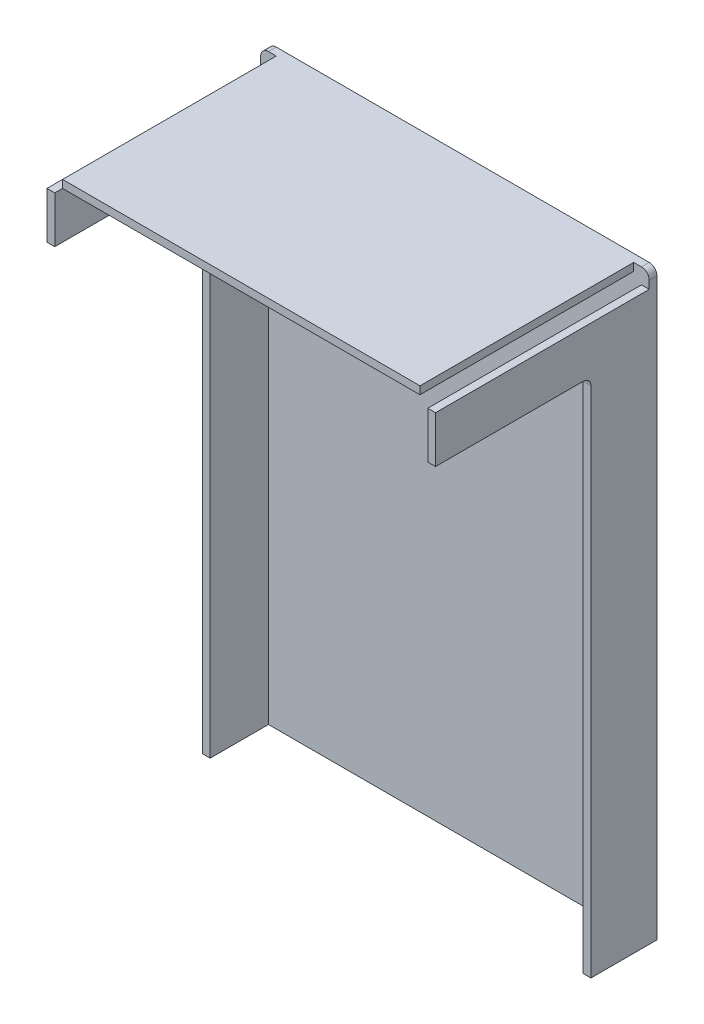
ISO-10303-21;
HEADER;
FILE_DESCRIPTION(('STEP AP214'),'2;1');
FILE_NAME('part.step','',(''),(''),'','','');
FILE_SCHEMA(('AUTOMOTIVE_DESIGN { 1 0 10303 214 1 1 1 1 }'));
ENDSEC;
DATA;
#1=APPLICATION_CONTEXT('core data for automotive mechanical design processes');
#2=APPLICATION_PROTOCOL_DEFINITION('international standard','automotive_design',2000,#1);
#3=PRODUCT_CONTEXT('',#1,'mechanical');
#4=PRODUCT('Part','Part','',(#3));
#5=PRODUCT_RELATED_PRODUCT_CATEGORY('part','',(#4));
#6=PRODUCT_DEFINITION_FORMATION('','',#4);
#7=PRODUCT_DEFINITION_CONTEXT('part definition',#1,'design');
#8=PRODUCT_DEFINITION('design','',#6,#7);
#9=PRODUCT_DEFINITION_SHAPE('','',#8);
#10=(LENGTH_UNIT() NAMED_UNIT(*) SI_UNIT(.MILLI.,.METRE.));
#11=(NAMED_UNIT(*) PLANE_ANGLE_UNIT() SI_UNIT($,.RADIAN.));
#12=(NAMED_UNIT(*) SI_UNIT($,.STERADIAN.) SOLID_ANGLE_UNIT());
#13=UNCERTAINTY_MEASURE_WITH_UNIT(LENGTH_MEASURE(1.E-05),#10,'distance_accuracy_value','');
#14=(GEOMETRIC_REPRESENTATION_CONTEXT(3) GLOBAL_UNCERTAINTY_ASSIGNED_CONTEXT((#13)) GLOBAL_UNIT_ASSIGNED_CONTEXT((#10,
#11,#12)) REPRESENTATION_CONTEXT('',''));
#15=CARTESIAN_POINT('',(0.,0.,0.));
#16=DIRECTION('',(0.,0.,1.));
#17=DIRECTION('',(1.,0.,0.));
#18=AXIS2_PLACEMENT_3D('',#15,#16,#17);
#19=CARTESIAN_POINT('',(0.,0.,21.59));
#20=DIRECTION('',(0.,0.,1.));
#21=DIRECTION('',(1.,0.,0.));
#22=AXIS2_PLACEMENT_3D('',#19,#20,#21);
#23=PLANE('',#22);
#24=DIRECTION('',(0.,1.,0.));
#25=VECTOR('',#24,1.);
#26=CARTESIAN_POINT('',(127.,0.,21.59));
#27=LINE('',#26,#25);
#28=CARTESIAN_POINT('',(127.,0.,21.59));
#29=VERTEX_POINT('',#28);
#30=CARTESIAN_POINT('',(127.,167.64,21.59));
#31=VERTEX_POINT('',#30);
#32=EDGE_CURVE('E270',#29,#31,#27,.T.);
#33=ORIENTED_EDGE('',*,*,#32,.T.);
#34=DIRECTION('',(1.,0.,0.));
#35=VECTOR('',#34,1.);
#36=CARTESIAN_POINT('',(0.,167.64,21.59));
#37=LINE('',#36,#35);
#38=CARTESIAN_POINT('',(124.46,167.64,21.59));
#39=VERTEX_POINT('',#38);
#40=EDGE_CURVE('E52',#31,#39,#37,.F.);
#41=ORIENTED_EDGE('',*,*,#40,.T.);
#42=DIRECTION('',(0.,-1.,0.));
#43=VECTOR('',#42,1.);
#44=CARTESIAN_POINT('',(124.46,0.,21.59));
#45=LINE('',#44,#43);
#46=CARTESIAN_POINT('',(124.46,0.,21.59));
#47=VERTEX_POINT('',#46);
#48=EDGE_CURVE('E264',#39,#47,#45,.T.);
#49=ORIENTED_EDGE('',*,*,#48,.T.);
#50=DIRECTION('',(1.,0.,0.));
#51=VECTOR('',#50,1.);
#52=CARTESIAN_POINT('',(0.,0.,21.59));
#53=LINE('',#52,#51);
#54=EDGE_CURVE('E266',#47,#29,#53,.T.);
#55=ORIENTED_EDGE('',*,*,#54,.T.);
#56=EDGE_LOOP('',(#33,#41,#49,#55));
#57=FACE_BOUND('',#56,.T.);
#58=ADVANCED_FACE('F37',(#57),#23,.T.);
#59=CARTESIAN_POINT('',(0.,0.,21.59));
#60=DIRECTION('',(0.,0.,1.));
#61=DIRECTION('',(1.,0.,0.));
#62=AXIS2_PLACEMENT_3D('',#59,#60,#61);
#63=PLANE('',#62);
#64=DIRECTION('',(0.,1.,0.));
#65=VECTOR('',#64,1.);
#66=CARTESIAN_POINT('',(2.54,0.,21.59));
#67=LINE('',#66,#65);
#68=CARTESIAN_POINT('',(2.54,0.,21.59));
#69=VERTEX_POINT('',#68);
#70=CARTESIAN_POINT('',(2.54,167.64,21.59));
#71=VERTEX_POINT('',#70);
#72=EDGE_CURVE('E242',#69,#71,#67,.T.);
#73=ORIENTED_EDGE('',*,*,#72,.T.);
#74=DIRECTION('',(1.,0.,0.));
#75=VECTOR('',#74,1.);
#76=CARTESIAN_POINT('',(0.,167.64,21.59));
#77=LINE('',#76,#75);
#78=CARTESIAN_POINT('',(0.,167.64,21.59));
#79=VERTEX_POINT('',#78);
#80=EDGE_CURVE('E350',#71,#79,#77,.F.);
#81=ORIENTED_EDGE('',*,*,#80,.T.);
#82=DIRECTION('',(0.,-1.,0.));
#83=VECTOR('',#82,1.);
#84=CARTESIAN_POINT('',(0.,0.,21.59));
#85=LINE('',#84,#83);
#86=CARTESIAN_POINT('',(0.,0.,21.59));
#87=VERTEX_POINT('',#86);
#88=EDGE_CURVE('E245',#79,#87,#85,.T.);
#89=ORIENTED_EDGE('',*,*,#88,.T.);
#90=DIRECTION('',(1.,0.,0.));
#91=VECTOR('',#90,1.);
#92=CARTESIAN_POINT('',(0.,0.,21.59));
#93=LINE('',#92,#91);
#94=EDGE_CURVE('E248',#87,#69,#93,.T.);
#95=ORIENTED_EDGE('',*,*,#94,.T.);
#96=EDGE_LOOP('',(#73,#81,#89,#95));
#97=FACE_BOUND('',#96,.T.);
#98=ADVANCED_FACE('F371',(#97),#63,.T.);
#99=CARTESIAN_POINT('',(0.,0.,2.54));
#100=DIRECTION('',(0.,0.,1.));
#101=DIRECTION('',(1.,0.,0.));
#102=AXIS2_PLACEMENT_3D('',#99,#100,#101);
#103=PLANE('',#102);
#104=DIRECTION('',(-1.,0.,0.));
#105=VECTOR('',#104,1.);
#106=CARTESIAN_POINT('',(127.,190.5,2.54));
#107=LINE('',#106,#105);
#108=CARTESIAN_POINT('',(5.08,190.5,2.54));
#109=VERTEX_POINT('',#108);
#110=CARTESIAN_POINT('',(2.54,190.5,2.54));
#111=VERTEX_POINT('',#110);
#112=EDGE_CURVE('E312',#109,#111,#107,.T.);
#113=ORIENTED_EDGE('',*,*,#112,.T.);
#114=CARTESIAN_POINT('',(2.54,187.96,2.54));
#115=DIRECTION('',(0.,0.,1.));
#116=DIRECTION('',(1.,0.,0.));
#117=AXIS2_PLACEMENT_3D('',#114,#115,#116);
#118=CIRCLE('',#117,2.54);
#119=CARTESIAN_POINT('',(0.,187.96,2.54));
#120=VERTEX_POINT('',#119);
#121=EDGE_CURVE('E343',#111,#120,#118,.T.);
#122=ORIENTED_EDGE('',*,*,#121,.T.);
#123=DIRECTION('',(0.,-1.,0.));
#124=VECTOR('',#123,1.);
#125=CARTESIAN_POINT('',(0.,190.5,2.54));
#126=LINE('',#125,#124);
#127=CARTESIAN_POINT('',(0.,185.42,2.54));
#128=VERTEX_POINT('',#127);
#129=EDGE_CURVE('E304',#120,#128,#126,.T.);
#130=ORIENTED_EDGE('',*,*,#129,.T.);
#131=DIRECTION('',(-1.,0.,0.));
#132=VECTOR('',#131,1.);
#133=CARTESIAN_POINT('',(0.,185.42,2.54));
#134=LINE('',#133,#132);
#135=CARTESIAN_POINT('',(2.54,185.42,2.54));
#136=VERTEX_POINT('',#135);
#137=EDGE_CURVE('E246',#136,#128,#134,.T.);
#138=ORIENTED_EDGE('',*,*,#137,.F.);
#139=DIRECTION('',(0.,1.,0.));
#140=VECTOR('',#139,1.);
#141=CARTESIAN_POINT('',(2.54,0.,2.54));
#142=LINE('',#141,#140);
#143=CARTESIAN_POINT('',(2.54,0.,2.54));
#144=VERTEX_POINT('',#143);
#145=EDGE_CURVE('E241',#144,#136,#142,.T.);
#146=ORIENTED_EDGE('',*,*,#145,.F.);
#147=DIRECTION('',(1.,0.,0.));
#148=VECTOR('',#147,1.);
#149=CARTESIAN_POINT('',(0.,0.,2.54));
#150=LINE('',#149,#148);
#151=CARTESIAN_POINT('',(124.46,0.,2.54));
#152=VERTEX_POINT('',#151);
#153=EDGE_CURVE('E306',#144,#152,#150,.T.);
#154=ORIENTED_EDGE('',*,*,#153,.T.);
#155=DIRECTION('',(0.,-1.,0.));
#156=VECTOR('',#155,1.);
#157=CARTESIAN_POINT('',(124.46,0.,2.54));
#158=LINE('',#157,#156);
#159=CARTESIAN_POINT('',(124.46,185.42,2.54));
#160=VERTEX_POINT('',#159);
#161=EDGE_CURVE('E267',#160,#152,#158,.T.);
#162=ORIENTED_EDGE('',*,*,#161,.F.);
#163=DIRECTION('',(1.,0.,0.));
#164=VECTOR('',#163,1.);
#165=CARTESIAN_POINT('',(0.,185.42,2.54));
#166=LINE('',#165,#164);
#167=CARTESIAN_POINT('',(127.,185.42,2.54));
#168=VERTEX_POINT('',#167);
#169=EDGE_CURVE('E263',#160,#168,#166,.T.);
#170=ORIENTED_EDGE('',*,*,#169,.T.);
#171=DIRECTION('',(0.,1.,0.));
#172=VECTOR('',#171,1.);
#173=CARTESIAN_POINT('',(127.,0.,2.54));
#174=LINE('',#173,#172);
#175=CARTESIAN_POINT('',(127.,187.96,2.54));
#176=VERTEX_POINT('',#175);
#177=EDGE_CURVE('E309',#168,#176,#174,.T.);
#178=ORIENTED_EDGE('',*,*,#177,.T.);
#179=CARTESIAN_POINT('',(124.46,187.96,2.54));
#180=DIRECTION('',(0.,0.,1.));
#181=DIRECTION('',(1.,0.,0.));
#182=AXIS2_PLACEMENT_3D('',#179,#180,#181);
#183=CIRCLE('',#182,2.54);
#184=CARTESIAN_POINT('',(124.46,190.5,2.54));
#185=VERTEX_POINT('',#184);
#186=EDGE_CURVE('E341',#176,#185,#183,.T.);
#187=ORIENTED_EDGE('',*,*,#186,.T.);
#188=CARTESIAN_POINT('',(121.92,190.5,2.54));
#189=VERTEX_POINT('',#188);
#190=EDGE_CURVE('E313',#185,#189,#107,.T.);
#191=ORIENTED_EDGE('',*,*,#190,.T.);
#192=DIRECTION('',(0.,1.,0.));
#193=VECTOR('',#192,1.);
#194=CARTESIAN_POINT('',(121.92,0.,2.54));
#195=LINE('',#194,#193);
#196=CARTESIAN_POINT('',(121.92,187.96,2.54));
#197=VERTEX_POINT('',#196);
#198=EDGE_CURVE('E286',#197,#189,#195,.T.);
#199=ORIENTED_EDGE('',*,*,#198,.F.);
#200=DIRECTION('',(1.,0.,0.));
#201=VECTOR('',#200,1.);
#202=CARTESIAN_POINT('',(0.,187.96,2.54));
#203=LINE('',#202,#201);
#204=CARTESIAN_POINT('',(5.08,187.96,2.54));
#205=VERTEX_POINT('',#204);
#206=EDGE_CURVE('E283',#205,#197,#203,.T.);
#207=ORIENTED_EDGE('',*,*,#206,.F.);
#208=DIRECTION('',(0.,1.,0.));
#209=VECTOR('',#208,1.);
#210=CARTESIAN_POINT('',(5.08000000000007,0.,2.54));
#211=LINE('',#210,#209);
#212=EDGE_CURVE('E289',#205,#109,#211,.T.);
#213=ORIENTED_EDGE('',*,*,#212,.T.);
#214=EDGE_LOOP('',(#113,#122,#130,#138,#146,#154,#162,#170,#178,#187,#191,#199,#207,#213));
#215=FACE_BOUND('',#214,.T.);
#216=ADVANCED_FACE('F376',(#215),#103,.T.);
#217=CARTESIAN_POINT('',(0.,190.5,2.54));
#218=DIRECTION('',(1.,0.,0.));
#219=DIRECTION('',(0.,1.,0.));
#220=AXIS2_PLACEMENT_3D('',#217,#218,#219);
#221=PLANE('',#220);
#222=ORIENTED_EDGE('',*,*,#129,.F.);
#223=DIRECTION('',(0.,0.,-1.));
#224=VECTOR('',#223,1.);
#225=CARTESIAN_POINT('',(0.,187.96,2.54));
#226=LINE('',#225,#224);
#227=CARTESIAN_POINT('',(0.,187.96,0.));
#228=VERTEX_POINT('',#227);
#229=EDGE_CURVE('E329',#120,#228,#226,.T.);
#230=ORIENTED_EDGE('',*,*,#229,.T.);
#231=DIRECTION('',(0.,-1.,0.));
#232=VECTOR('',#231,1.);
#233=CARTESIAN_POINT('',(0.,190.5,0.));
#234=LINE('',#233,#232);
#235=CARTESIAN_POINT('',(0.,0.,0.));
#236=VERTEX_POINT('',#235);
#237=EDGE_CURVE('E303',#228,#236,#234,.T.);
#238=ORIENTED_EDGE('',*,*,#237,.T.);
#239=DIRECTION('',(0.,0.,-1.));
#240=VECTOR('',#239,1.);
#241=CARTESIAN_POINT('',(0.,0.,2.54));
#242=LINE('',#241,#240);
#243=EDGE_CURVE('E326',#87,#236,#242,.T.);
#244=ORIENTED_EDGE('',*,*,#243,.F.);
#245=ORIENTED_EDGE('',*,*,#88,.F.);
#246=CARTESIAN_POINT('',(0.,167.64,24.13));
#247=DIRECTION('',(1.,0.,0.));
#248=DIRECTION('',(0.,1.,0.));
#249=AXIS2_PLACEMENT_3D('',#246,#247,#248);
#250=CIRCLE('',#249,2.54);
#251=CARTESIAN_POINT('',(0.,170.18,24.13));
#252=VERTEX_POINT('',#251);
#253=EDGE_CURVE('E357',#79,#252,#250,.T.);
#254=ORIENTED_EDGE('',*,*,#253,.T.);
#255=DIRECTION('',(0.,0.,-1.));
#256=VECTOR('',#255,1.);
#257=CARTESIAN_POINT('',(0.,170.18,72.39));
#258=LINE('',#257,#256);
#259=CARTESIAN_POINT('',(0.,170.18,72.39));
#260=VERTEX_POINT('',#259);
#261=EDGE_CURVE('E238',#260,#252,#258,.T.);
#262=ORIENTED_EDGE('',*,*,#261,.F.);
#263=DIRECTION('',(0.,-1.,0.));
#264=VECTOR('',#263,1.);
#265=CARTESIAN_POINT('',(0.,185.42,72.39));
#266=LINE('',#265,#264);
#267=CARTESIAN_POINT('',(0.,185.42,72.39));
#268=VERTEX_POINT('',#267);
#269=EDGE_CURVE('E224',#268,#260,#266,.T.);
#270=ORIENTED_EDGE('',*,*,#269,.F.);
#271=DIRECTION('',(0.,0.,-1.));
#272=VECTOR('',#271,1.);
#273=CARTESIAN_POINT('',(0.,185.42,21.59));
#274=LINE('',#273,#272);
#275=EDGE_CURVE('E257',#268,#128,#274,.T.);
#276=ORIENTED_EDGE('',*,*,#275,.T.);
#277=EDGE_LOOP('',(#222,#230,#238,#244,#245,#254,#262,#270,#276));
#278=FACE_BOUND('',#277,.T.);
#279=ADVANCED_FACE('F404',(#278),#221,.F.);
#280=CARTESIAN_POINT('',(0.,0.,2.54));
#281=DIRECTION('',(0.,1.,0.));
#282=DIRECTION('',(0.,0.,1.));
#283=AXIS2_PLACEMENT_3D('',#280,#281,#282);
#284=PLANE('',#283);
#285=DIRECTION('',(1.,0.,0.));
#286=VECTOR('',#285,1.);
#287=CARTESIAN_POINT('',(0.,0.,0.));
#288=LINE('',#287,#286);
#289=CARTESIAN_POINT('',(127.,0.,0.));
#290=VERTEX_POINT('',#289);
#291=EDGE_CURVE('E317',#236,#290,#288,.T.);
#292=ORIENTED_EDGE('',*,*,#291,.T.);
#293=DIRECTION('',(0.,0.,-1.));
#294=VECTOR('',#293,1.);
#295=CARTESIAN_POINT('',(127.,0.,2.54));
#296=LINE('',#295,#294);
#297=EDGE_CURVE('E315',#29,#290,#296,.T.);
#298=ORIENTED_EDGE('',*,*,#297,.F.);
#299=ORIENTED_EDGE('',*,*,#54,.F.);
#300=DIRECTION('',(0.,0.,-1.));
#301=VECTOR('',#300,1.);
#302=CARTESIAN_POINT('',(124.46,0.,21.59));
#303=LINE('',#302,#301);
#304=EDGE_CURVE('E278',#47,#152,#303,.T.);
#305=ORIENTED_EDGE('',*,*,#304,.T.);
#306=ORIENTED_EDGE('',*,*,#153,.F.);
#307=DIRECTION('',(0.,0.,-1.));
#308=VECTOR('',#307,1.);
#309=CARTESIAN_POINT('',(2.54,0.,21.59));
#310=LINE('',#309,#308);
#311=EDGE_CURVE('E250',#69,#144,#310,.T.);
#312=ORIENTED_EDGE('',*,*,#311,.F.);
#313=ORIENTED_EDGE('',*,*,#94,.F.);
#314=ORIENTED_EDGE('',*,*,#243,.T.);
#315=EDGE_LOOP('',(#292,#298,#299,#305,#306,#312,#313,#314));
#316=FACE_BOUND('',#315,.T.);
#317=ADVANCED_FACE('F415',(#316),#284,.F.);
#318=CARTESIAN_POINT('',(127.,0.,2.54));
#319=DIRECTION('',(-1.,0.,0.));
#320=DIRECTION('',(0.,0.,1.));
#321=AXIS2_PLACEMENT_3D('',#318,#319,#320);
#322=PLANE('',#321);
#323=DIRECTION('',(0.,1.,0.));
#324=VECTOR('',#323,1.);
#325=CARTESIAN_POINT('',(127.,0.,0.));
#326=LINE('',#325,#324);
#327=CARTESIAN_POINT('',(127.,187.96,0.));
#328=VERTEX_POINT('',#327);
#329=EDGE_CURVE('E319',#290,#328,#326,.T.);
#330=ORIENTED_EDGE('',*,*,#329,.T.);
#331=DIRECTION('',(0.,0.,-1.));
#332=VECTOR('',#331,1.);
#333=CARTESIAN_POINT('',(127.,187.96,2.54));
#334=LINE('',#333,#332);
#335=EDGE_CURVE('E345',#328,#176,#334,.F.);
#336=ORIENTED_EDGE('',*,*,#335,.T.);
#337=ORIENTED_EDGE('',*,*,#177,.F.);
#338=DIRECTION('',(0.,0.,-1.));
#339=VECTOR('',#338,1.);
#340=CARTESIAN_POINT('',(127.,185.42,21.59));
#341=LINE('',#340,#339);
#342=CARTESIAN_POINT('',(127.,185.42,72.39));
#343=VERTEX_POINT('',#342);
#344=EDGE_CURVE('E272',#343,#168,#341,.T.);
#345=ORIENTED_EDGE('',*,*,#344,.F.);
#346=DIRECTION('',(0.,1.,0.));
#347=VECTOR('',#346,1.);
#348=CARTESIAN_POINT('',(127.,185.42,72.39));
#349=LINE('',#348,#347);
#350=CARTESIAN_POINT('',(127.,170.18,72.39));
#351=VERTEX_POINT('',#350);
#352=EDGE_CURVE('E196',#351,#343,#349,.T.);
#353=ORIENTED_EDGE('',*,*,#352,.F.);
#354=DIRECTION('',(0.,0.,-1.));
#355=VECTOR('',#354,1.);
#356=CARTESIAN_POINT('',(127.,170.18,72.39));
#357=LINE('',#356,#355);
#358=CARTESIAN_POINT('',(127.,170.18,24.13));
#359=VERTEX_POINT('',#358);
#360=EDGE_CURVE('E192',#351,#359,#357,.T.);
#361=ORIENTED_EDGE('',*,*,#360,.T.);
#362=CARTESIAN_POINT('',(127.,167.64,24.13));
#363=DIRECTION('',(-1.,0.,0.));
#364=DIRECTION('',(0.,0.,1.));
#365=AXIS2_PLACEMENT_3D('',#362,#363,#364);
#366=CIRCLE('',#365,2.54);
#367=EDGE_CURVE('E45',#359,#31,#366,.T.);
#368=ORIENTED_EDGE('',*,*,#367,.T.);
#369=ORIENTED_EDGE('',*,*,#32,.F.);
#370=ORIENTED_EDGE('',*,*,#297,.T.);
#371=EDGE_LOOP('',(#330,#336,#337,#345,#353,#361,#368,#369,#370));
#372=FACE_BOUND('',#371,.T.);
#373=ADVANCED_FACE('F360',(#372),#322,.F.);
#374=CARTESIAN_POINT('',(127.,190.5,2.54));
#375=DIRECTION('',(0.,-1.,0.));
#376=DIRECTION('',(1.,0.,0.));
#377=AXIS2_PLACEMENT_3D('',#374,#375,#376);
#378=PLANE('',#377);
#379=DIRECTION('',(-1.,0.,0.));
#380=VECTOR('',#379,1.);
#381=CARTESIAN_POINT('',(127.,190.5,0.));
#382=LINE('',#381,#380);
#383=CARTESIAN_POINT('',(124.46,190.5,0.));
#384=VERTEX_POINT('',#383);
#385=CARTESIAN_POINT('',(2.54,190.5,0.));
#386=VERTEX_POINT('',#385);
#387=EDGE_CURVE('E307',#384,#386,#382,.T.);
#388=ORIENTED_EDGE('',*,*,#387,.T.);
#389=DIRECTION('',(0.,0.,-1.));
#390=VECTOR('',#389,1.);
#391=CARTESIAN_POINT('',(2.54,190.5,2.54));
#392=LINE('',#391,#390);
#393=EDGE_CURVE('E339',#386,#111,#392,.F.);
#394=ORIENTED_EDGE('',*,*,#393,.T.);
#395=ORIENTED_EDGE('',*,*,#112,.F.);
#396=DIRECTION('',(0.,0.,-1.));
#397=VECTOR('',#396,1.);
#398=CARTESIAN_POINT('',(5.08,190.5,21.59));
#399=LINE('',#398,#397);
#400=CARTESIAN_POINT('',(5.08,190.5,72.39));
#401=VERTEX_POINT('',#400);
#402=EDGE_CURVE('E294',#401,#109,#399,.T.);
#403=ORIENTED_EDGE('',*,*,#402,.F.);
#404=DIRECTION('',(-1.,0.,0.));
#405=VECTOR('',#404,1.);
#406=CARTESIAN_POINT('',(5.08,190.5,72.39));
#407=LINE('',#406,#405);
#408=CARTESIAN_POINT('',(121.92,190.5,72.39));
#409=VERTEX_POINT('',#408);
#410=EDGE_CURVE('E221',#409,#401,#407,.T.);
#411=ORIENTED_EDGE('',*,*,#410,.F.);
#412=DIRECTION('',(0.,0.,-1.));
#413=VECTOR('',#412,1.);
#414=CARTESIAN_POINT('',(121.92,190.5,21.59));
#415=LINE('',#414,#413);
#416=EDGE_CURVE('E297',#409,#189,#415,.T.);
#417=ORIENTED_EDGE('',*,*,#416,.T.);
#418=ORIENTED_EDGE('',*,*,#190,.F.);
#419=DIRECTION('',(0.,0.,-1.));
#420=VECTOR('',#419,1.);
#421=CARTESIAN_POINT('',(124.46,190.5,2.54));
#422=LINE('',#421,#420);
#423=EDGE_CURVE('E336',#185,#384,#422,.T.);
#424=ORIENTED_EDGE('',*,*,#423,.T.);
#425=EDGE_LOOP('',(#388,#394,#395,#403,#411,#417,#418,#424));
#426=FACE_BOUND('',#425,.T.);
#427=ADVANCED_FACE('F408',(#426),#378,.F.);
#428=CARTESIAN_POINT('',(0.,0.,0.));
#429=DIRECTION('',(0.,0.,1.));
#430=DIRECTION('',(1.,0.,0.));
#431=AXIS2_PLACEMENT_3D('',#428,#429,#430);
#432=PLANE('',#431);
#433=ORIENTED_EDGE('',*,*,#237,.F.);
#434=CARTESIAN_POINT('',(2.54,187.96,0.));
#435=DIRECTION('',(0.,0.,1.));
#436=DIRECTION('',(1.,0.,0.));
#437=AXIS2_PLACEMENT_3D('',#434,#435,#436);
#438=CIRCLE('',#437,2.54);
#439=EDGE_CURVE('E334',#228,#386,#438,.F.);
#440=ORIENTED_EDGE('',*,*,#439,.T.);
#441=ORIENTED_EDGE('',*,*,#387,.F.);
#442=CARTESIAN_POINT('',(124.46,187.96,0.));
#443=DIRECTION('',(0.,0.,1.));
#444=DIRECTION('',(1.,0.,0.));
#445=AXIS2_PLACEMENT_3D('',#442,#443,#444);
#446=CIRCLE('',#445,2.54);
#447=EDGE_CURVE('E332',#384,#328,#446,.F.);
#448=ORIENTED_EDGE('',*,*,#447,.T.);
#449=ORIENTED_EDGE('',*,*,#329,.F.);
#450=ORIENTED_EDGE('',*,*,#291,.F.);
#451=EDGE_LOOP('',(#433,#440,#441,#448,#449,#450));
#452=FACE_BOUND('',#451,.T.);
#453=ADVANCED_FACE('F400',(#452),#432,.F.);
#454=CARTESIAN_POINT('',(0.,187.96,21.59));
#455=DIRECTION('',(0.,1.,0.));
#456=DIRECTION('',(0.,0.,1.));
#457=AXIS2_PLACEMENT_3D('',#454,#455,#456);
#458=PLANE('',#457);
#459=ORIENTED_EDGE('',*,*,#206,.T.);
#460=DIRECTION('',(0.,0.,-1.));
#461=VECTOR('',#460,1.);
#462=CARTESIAN_POINT('',(121.92,187.96,21.59));
#463=LINE('',#462,#461);
#464=CARTESIAN_POINT('',(121.92,187.96,72.39));
#465=VERTEX_POINT('',#464);
#466=EDGE_CURVE('E300',#465,#197,#463,.T.);
#467=ORIENTED_EDGE('',*,*,#466,.F.);
#468=DIRECTION('',(1.,0.,0.));
#469=VECTOR('',#468,1.);
#470=CARTESIAN_POINT('',(5.08,187.96,72.39));
#471=LINE('',#470,#469);
#472=CARTESIAN_POINT('',(5.08,187.96,72.39));
#473=VERTEX_POINT('',#472);
#474=EDGE_CURVE('E211',#473,#465,#471,.T.);
#475=ORIENTED_EDGE('',*,*,#474,.F.);
#476=DIRECTION('',(0.,0.,-1.));
#477=VECTOR('',#476,1.);
#478=CARTESIAN_POINT('',(5.08,187.96,21.59));
#479=LINE('',#478,#477);
#480=EDGE_CURVE('E291',#473,#205,#479,.T.);
#481=ORIENTED_EDGE('',*,*,#480,.T.);
#482=EDGE_LOOP('',(#459,#467,#475,#481));
#483=FACE_BOUND('',#482,.T.);
#484=ADVANCED_FACE('F396',(#483),#458,.F.);
#485=CARTESIAN_POINT('',(121.92,0.,21.59));
#486=DIRECTION('',(-1.,0.,0.));
#487=DIRECTION('',(0.,0.,1.));
#488=AXIS2_PLACEMENT_3D('',#485,#486,#487);
#489=PLANE('',#488);
#490=ORIENTED_EDGE('',*,*,#198,.T.);
#491=ORIENTED_EDGE('',*,*,#416,.F.);
#492=DIRECTION('',(0.,1.,0.));
#493=VECTOR('',#492,1.);
#494=CARTESIAN_POINT('',(121.92,190.5,72.39));
#495=LINE('',#494,#493);
#496=EDGE_CURVE('E218',#465,#409,#495,.T.);
#497=ORIENTED_EDGE('',*,*,#496,.F.);
#498=ORIENTED_EDGE('',*,*,#466,.T.);
#499=EDGE_LOOP('',(#490,#491,#497,#498));
#500=FACE_BOUND('',#499,.T.);
#501=ADVANCED_FACE('F392',(#500),#489,.F.);
#502=CARTESIAN_POINT('',(5.08000000000007,0.,21.59));
#503=DIRECTION('',(-1.,0.,0.));
#504=DIRECTION('',(0.,-1.,0.));
#505=AXIS2_PLACEMENT_3D('',#502,#503,#504);
#506=PLANE('',#505);
#507=ORIENTED_EDGE('',*,*,#212,.F.);
#508=ORIENTED_EDGE('',*,*,#480,.F.);
#509=DIRECTION('',(0.,-1.,0.));
#510=VECTOR('',#509,1.);
#511=CARTESIAN_POINT('',(5.08,190.5,72.39));
#512=LINE('',#511,#510);
#513=EDGE_CURVE('E208',#401,#473,#512,.T.);
#514=ORIENTED_EDGE('',*,*,#513,.F.);
#515=ORIENTED_EDGE('',*,*,#402,.T.);
#516=EDGE_LOOP('',(#507,#508,#514,#515));
#517=FACE_BOUND('',#516,.T.);
#518=ADVANCED_FACE('F388',(#517),#506,.T.);
#519=CARTESIAN_POINT('',(0.,185.42,21.59));
#520=DIRECTION('',(0.,1.,0.));
#521=DIRECTION('',(0.,0.,1.));
#522=AXIS2_PLACEMENT_3D('',#519,#520,#521);
#523=PLANE('',#522);
#524=ORIENTED_EDGE('',*,*,#169,.F.);
#525=DIRECTION('',(0.,0.,-1.));
#526=VECTOR('',#525,1.);
#527=CARTESIAN_POINT('',(124.46,185.42,21.59));
#528=LINE('',#527,#526);
#529=CARTESIAN_POINT('',(124.46,185.42,72.39));
#530=VERTEX_POINT('',#529);
#531=EDGE_CURVE('E281',#530,#160,#528,.T.);
#532=ORIENTED_EDGE('',*,*,#531,.F.);
#533=DIRECTION('',(-1.,0.,0.));
#534=VECTOR('',#533,1.);
#535=CARTESIAN_POINT('',(124.46,185.42,72.39));
#536=LINE('',#535,#534);
#537=EDGE_CURVE('E203',#343,#530,#536,.T.);
#538=ORIENTED_EDGE('',*,*,#537,.F.);
#539=ORIENTED_EDGE('',*,*,#344,.T.);
#540=EDGE_LOOP('',(#524,#532,#538,#539));
#541=FACE_BOUND('',#540,.T.);
#542=ADVANCED_FACE('F385',(#541),#523,.T.);
#543=CARTESIAN_POINT('',(124.46,0.,21.59));
#544=DIRECTION('',(1.,0.,0.));
#545=DIRECTION('',(0.,1.,0.));
#546=AXIS2_PLACEMENT_3D('',#543,#544,#545);
#547=PLANE('',#546);
#548=ORIENTED_EDGE('',*,*,#161,.T.);
#549=ORIENTED_EDGE('',*,*,#304,.F.);
#550=ORIENTED_EDGE('',*,*,#48,.F.);
#551=CARTESIAN_POINT('',(124.46,167.64,24.13));
#552=DIRECTION('',(1.,0.,0.));
#553=DIRECTION('',(0.,1.,0.));
#554=AXIS2_PLACEMENT_3D('',#551,#552,#553);
#555=CIRCLE('',#554,2.54);
#556=CARTESIAN_POINT('',(124.46,170.18,24.13));
#557=VERTEX_POINT('',#556);
#558=EDGE_CURVE('E11',#39,#557,#555,.T.);
#559=ORIENTED_EDGE('',*,*,#558,.T.);
#560=DIRECTION('',(0.,0.,-1.));
#561=VECTOR('',#560,1.);
#562=CARTESIAN_POINT('',(124.46,170.18,72.39));
#563=LINE('',#562,#561);
#564=CARTESIAN_POINT('',(124.46,170.18,72.39));
#565=VERTEX_POINT('',#564);
#566=EDGE_CURVE('E189',#565,#557,#563,.T.);
#567=ORIENTED_EDGE('',*,*,#566,.F.);
#568=DIRECTION('',(0.,-1.,0.));
#569=VECTOR('',#568,1.);
#570=CARTESIAN_POINT('',(124.46,185.42,72.39));
#571=LINE('',#570,#569);
#572=EDGE_CURVE('E197',#530,#565,#571,.T.);
#573=ORIENTED_EDGE('',*,*,#572,.F.);
#574=ORIENTED_EDGE('',*,*,#531,.T.);
#575=EDGE_LOOP('',(#548,#549,#550,#559,#567,#573,#574));
#576=FACE_BOUND('',#575,.T.);
#577=ADVANCED_FACE('F207',(#576),#547,.F.);
#578=CARTESIAN_POINT('',(2.54,0.,21.59));
#579=DIRECTION('',(-1.,0.,0.));
#580=DIRECTION('',(0.,-1.,0.));
#581=AXIS2_PLACEMENT_3D('',#578,#579,#580);
#582=PLANE('',#581);
#583=ORIENTED_EDGE('',*,*,#145,.T.);
#584=DIRECTION('',(0.,0.,-1.));
#585=VECTOR('',#584,1.);
#586=CARTESIAN_POINT('',(2.54,185.42,21.59));
#587=LINE('',#586,#585);
#588=CARTESIAN_POINT('',(2.54,185.42,72.39));
#589=VERTEX_POINT('',#588);
#590=EDGE_CURVE('E260',#589,#136,#587,.T.);
#591=ORIENTED_EDGE('',*,*,#590,.F.);
#592=DIRECTION('',(0.,1.,0.));
#593=VECTOR('',#592,1.);
#594=CARTESIAN_POINT('',(2.54,185.42,72.39));
#595=LINE('',#594,#593);
#596=CARTESIAN_POINT('',(2.54,170.18,72.39));
#597=VERTEX_POINT('',#596);
#598=EDGE_CURVE('E229',#597,#589,#595,.T.);
#599=ORIENTED_EDGE('',*,*,#598,.F.);
#600=DIRECTION('',(0.,0.,-1.));
#601=VECTOR('',#600,1.);
#602=CARTESIAN_POINT('',(2.54,170.18,72.39));
#603=LINE('',#602,#601);
#604=CARTESIAN_POINT('',(2.54,170.18,24.13));
#605=VERTEX_POINT('',#604);
#606=EDGE_CURVE('E235',#597,#605,#603,.T.);
#607=ORIENTED_EDGE('',*,*,#606,.T.);
#608=CARTESIAN_POINT('',(2.54,167.64,24.13));
#609=DIRECTION('',(-1.,0.,0.));
#610=DIRECTION('',(0.,-1.,0.));
#611=AXIS2_PLACEMENT_3D('',#608,#609,#610);
#612=CIRCLE('',#611,2.54);
#613=EDGE_CURVE('E355',#605,#71,#612,.T.);
#614=ORIENTED_EDGE('',*,*,#613,.T.);
#615=ORIENTED_EDGE('',*,*,#72,.F.);
#616=ORIENTED_EDGE('',*,*,#311,.T.);
#617=EDGE_LOOP('',(#583,#591,#599,#607,#614,#615,#616));
#618=FACE_BOUND('',#617,.T.);
#619=ADVANCED_FACE('F381',(#618),#582,.F.);
#620=CARTESIAN_POINT('',(0.,185.42,21.59));
#621=DIRECTION('',(0.,-1.,0.));
#622=DIRECTION('',(0.,0.,-1.));
#623=AXIS2_PLACEMENT_3D('',#620,#621,#622);
#624=PLANE('',#623);
#625=ORIENTED_EDGE('',*,*,#137,.T.);
#626=ORIENTED_EDGE('',*,*,#275,.F.);
#627=DIRECTION('',(-1.,0.,0.));
#628=VECTOR('',#627,1.);
#629=CARTESIAN_POINT('',(0.,185.42,72.39));
#630=LINE('',#629,#628);
#631=EDGE_CURVE('E232',#589,#268,#630,.T.);
#632=ORIENTED_EDGE('',*,*,#631,.F.);
#633=ORIENTED_EDGE('',*,*,#590,.T.);
#634=EDGE_LOOP('',(#625,#626,#632,#633));
#635=FACE_BOUND('',#634,.T.);
#636=ADVANCED_FACE('F453',(#635),#624,.F.);
#637=CARTESIAN_POINT('',(0.,170.18,72.39));
#638=DIRECTION('',(0.,1.,0.));
#639=DIRECTION('',(0.,0.,1.));
#640=AXIS2_PLACEMENT_3D('',#637,#638,#639);
#641=PLANE('',#640);
#642=ORIENTED_EDGE('',*,*,#261,.T.);
#643=DIRECTION('',(1.,0.,0.));
#644=VECTOR('',#643,1.);
#645=CARTESIAN_POINT('',(0.,170.18,24.13));
#646=LINE('',#645,#644);
#647=EDGE_CURVE('E347',#252,#605,#646,.T.);
#648=ORIENTED_EDGE('',*,*,#647,.T.);
#649=ORIENTED_EDGE('',*,*,#606,.F.);
#650=DIRECTION('',(1.,0.,0.));
#651=VECTOR('',#650,1.);
#652=CARTESIAN_POINT('',(0.,170.18,72.39));
#653=LINE('',#652,#651);
#654=EDGE_CURVE('E227',#260,#597,#653,.T.);
#655=ORIENTED_EDGE('',*,*,#654,.F.);
#656=EDGE_LOOP('',(#642,#648,#649,#655));
#657=FACE_BOUND('',#656,.T.);
#658=ADVANCED_FACE('F473',(#657),#641,.F.);
#659=CARTESIAN_POINT('',(0.,0.,72.39));
#660=DIRECTION('',(0.,0.,1.));
#661=DIRECTION('',(1.,0.,0.));
#662=AXIS2_PLACEMENT_3D('',#659,#660,#661);
#663=PLANE('',#662);
#664=ORIENTED_EDGE('',*,*,#269,.T.);
#665=ORIENTED_EDGE('',*,*,#654,.T.);
#666=ORIENTED_EDGE('',*,*,#598,.T.);
#667=ORIENTED_EDGE('',*,*,#631,.T.);
#668=EDGE_LOOP('',(#664,#665,#666,#667));
#669=FACE_BOUND('',#668,.T.);
#670=ADVANCED_FACE('F455',(#669),#663,.T.);
#671=CARTESIAN_POINT('',(0.,0.,72.39));
#672=DIRECTION('',(0.,0.,1.));
#673=DIRECTION('',(1.,0.,0.));
#674=AXIS2_PLACEMENT_3D('',#671,#672,#673);
#675=PLANE('',#674);
#676=ORIENTED_EDGE('',*,*,#513,.T.);
#677=ORIENTED_EDGE('',*,*,#474,.T.);
#678=ORIENTED_EDGE('',*,*,#496,.T.);
#679=ORIENTED_EDGE('',*,*,#410,.T.);
#680=EDGE_LOOP('',(#676,#677,#678,#679));
#681=FACE_BOUND('',#680,.T.);
#682=ADVANCED_FACE('F439',(#681),#675,.T.);
#683=CARTESIAN_POINT('',(124.46,170.18,72.39));
#684=DIRECTION('',(0.,1.,0.));
#685=DIRECTION('',(0.,0.,1.));
#686=AXIS2_PLACEMENT_3D('',#683,#684,#685);
#687=PLANE('',#686);
#688=ORIENTED_EDGE('',*,*,#566,.T.);
#689=DIRECTION('',(1.,0.,0.));
#690=VECTOR('',#689,1.);
#691=CARTESIAN_POINT('',(124.46,170.18,24.13));
#692=LINE('',#691,#690);
#693=EDGE_CURVE('E352',#557,#359,#692,.T.);
#694=ORIENTED_EDGE('',*,*,#693,.T.);
#695=ORIENTED_EDGE('',*,*,#360,.F.);
#696=DIRECTION('',(1.,0.,0.));
#697=VECTOR('',#696,1.);
#698=CARTESIAN_POINT('',(124.46,170.18,72.39));
#699=LINE('',#698,#697);
#700=EDGE_CURVE('E185',#565,#351,#699,.T.);
#701=ORIENTED_EDGE('',*,*,#700,.F.);
#702=EDGE_LOOP('',(#688,#694,#695,#701));
#703=FACE_BOUND('',#702,.T.);
#704=ADVANCED_FACE('F187',(#703),#687,.F.);
#705=CARTESIAN_POINT('',(0.,0.,72.39));
#706=DIRECTION('',(0.,0.,1.));
#707=DIRECTION('',(1.,0.,0.));
#708=AXIS2_PLACEMENT_3D('',#705,#706,#707);
#709=PLANE('',#708);
#710=ORIENTED_EDGE('',*,*,#572,.T.);
#711=ORIENTED_EDGE('',*,*,#700,.T.);
#712=ORIENTED_EDGE('',*,*,#352,.T.);
#713=ORIENTED_EDGE('',*,*,#537,.T.);
#714=EDGE_LOOP('',(#710,#711,#712,#713));
#715=FACE_BOUND('',#714,.T.);
#716=ADVANCED_FACE('F201',(#715),#709,.T.);
#717=CARTESIAN_POINT('',(2.54,187.96,2.54));
#718=DIRECTION('',(0.,0.,-1.));
#719=DIRECTION('',(-1.,0.,0.));
#720=AXIS2_PLACEMENT_3D('',#717,#718,#719);
#721=CYLINDRICAL_SURFACE('',#720,2.54);
#722=ORIENTED_EDGE('',*,*,#121,.F.);
#723=ORIENTED_EDGE('',*,*,#393,.F.);
#724=ORIENTED_EDGE('',*,*,#439,.F.);
#725=ORIENTED_EDGE('',*,*,#229,.F.);
#726=EDGE_LOOP('',(#722,#723,#724,#725));
#727=FACE_BOUND('',#726,.T.);
#728=ADVANCED_FACE('F422',(#727),#721,.T.);
#729=CARTESIAN_POINT('',(124.46,187.96,2.54));
#730=DIRECTION('',(0.,0.,-1.));
#731=DIRECTION('',(-1.,0.,0.));
#732=AXIS2_PLACEMENT_3D('',#729,#730,#731);
#733=CYLINDRICAL_SURFACE('',#732,2.54);
#734=ORIENTED_EDGE('',*,*,#186,.F.);
#735=ORIENTED_EDGE('',*,*,#335,.F.);
#736=ORIENTED_EDGE('',*,*,#447,.F.);
#737=ORIENTED_EDGE('',*,*,#423,.F.);
#738=EDGE_LOOP('',(#734,#735,#736,#737));
#739=FACE_BOUND('',#738,.T.);
#740=ADVANCED_FACE('F368',(#739),#733,.T.);
#741=CARTESIAN_POINT('',(0.,167.64,24.13));
#742=DIRECTION('',(1.,0.,0.));
#743=DIRECTION('',(0.,0.,-1.));
#744=AXIS2_PLACEMENT_3D('',#741,#742,#743);
#745=CYLINDRICAL_SURFACE('',#744,2.54);
#746=ORIENTED_EDGE('',*,*,#253,.F.);
#747=ORIENTED_EDGE('',*,*,#80,.F.);
#748=ORIENTED_EDGE('',*,*,#613,.F.);
#749=ORIENTED_EDGE('',*,*,#647,.F.);
#750=EDGE_LOOP('',(#746,#747,#748,#749));
#751=FACE_BOUND('',#750,.T.);
#752=ADVANCED_FACE('F364',(#751),#745,.F.);
#753=CARTESIAN_POINT('',(124.46,167.64,24.13));
#754=DIRECTION('',(1.,0.,0.));
#755=DIRECTION('',(0.,0.,-1.));
#756=AXIS2_PLACEMENT_3D('',#753,#754,#755);
#757=CYLINDRICAL_SURFACE('',#756,2.54);
#758=ORIENTED_EDGE('',*,*,#558,.F.);
#759=ORIENTED_EDGE('',*,*,#40,.F.);
#760=ORIENTED_EDGE('',*,*,#367,.F.);
#761=ORIENTED_EDGE('',*,*,#693,.F.);
#762=EDGE_LOOP('',(#758,#759,#760,#761));
#763=FACE_BOUND('',#762,.T.);
#764=ADVANCED_FACE('F39',(#763),#757,.F.);
#765=CLOSED_SHELL('',(#58,#98,#216,#279,#317,#373,#427,#453,#484,#501,#518,#542,#577,#619,#636,
#658,#670,#682,#704,#716,#728,#740,#752,#764));
#766=MANIFOLD_SOLID_BREP('B2',#765);
#767=ADVANCED_BREP_SHAPE_REPRESENTATION('',(#18,#766),#14);
#768=SHAPE_DEFINITION_REPRESENTATION(#9,#767);
ENDSEC;
END-ISO-10303-21;
